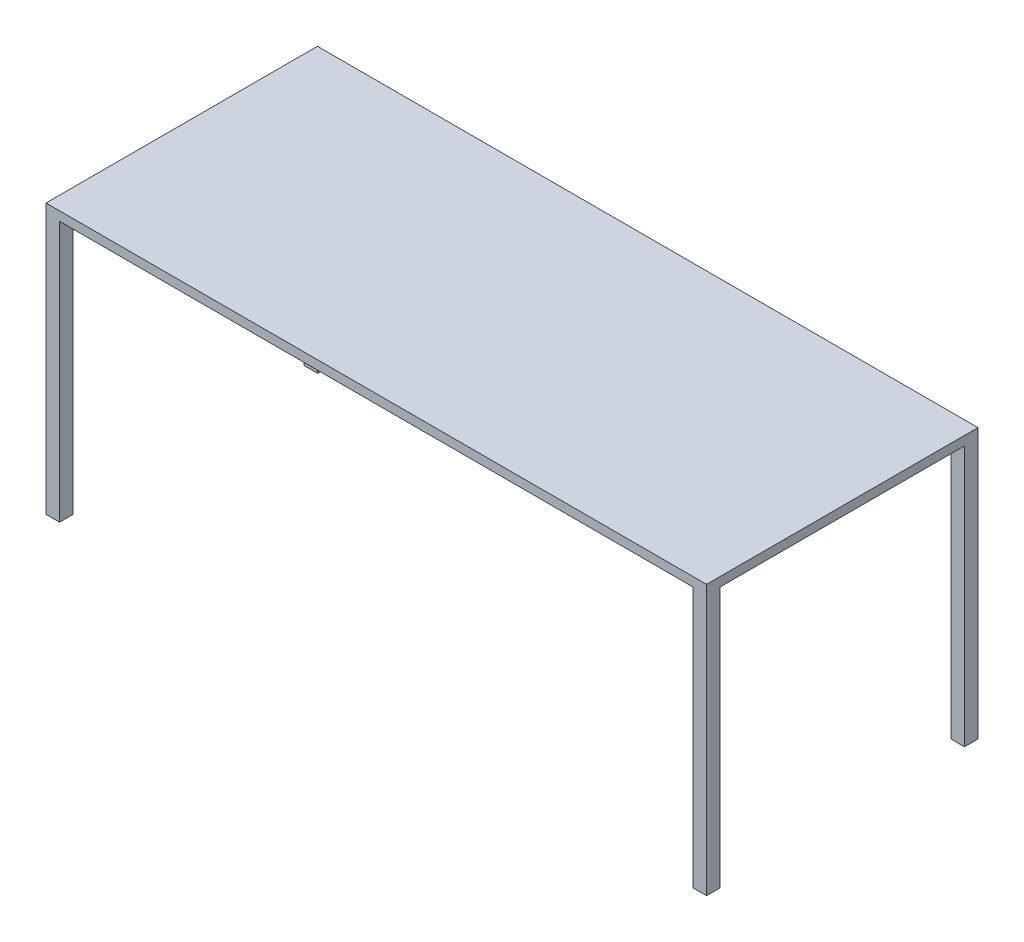
ISO-10303-21;
HEADER;
FILE_DESCRIPTION(('STEP AP214'),'2;1');
FILE_NAME('part.step','',(''),(''),'','','');
FILE_SCHEMA(('AUTOMOTIVE_DESIGN { 1 0 10303 214 1 1 1 1 }'));
ENDSEC;
DATA;
#1=APPLICATION_CONTEXT('core data for automotive mechanical design processes');
#2=APPLICATION_PROTOCOL_DEFINITION('international standard','automotive_design',2000,#1);
#3=PRODUCT_CONTEXT('',#1,'mechanical');
#4=PRODUCT('Part','Part','',(#3));
#5=PRODUCT_RELATED_PRODUCT_CATEGORY('part','',(#4));
#6=PRODUCT_DEFINITION_FORMATION('','',#4);
#7=PRODUCT_DEFINITION_CONTEXT('part definition',#1,'design');
#8=PRODUCT_DEFINITION('design','',#6,#7);
#9=PRODUCT_DEFINITION_SHAPE('','',#8);
#10=(LENGTH_UNIT() NAMED_UNIT(*) SI_UNIT(.MILLI.,.METRE.));
#11=(NAMED_UNIT(*) PLANE_ANGLE_UNIT() SI_UNIT($,.RADIAN.));
#12=(NAMED_UNIT(*) SI_UNIT($,.STERADIAN.) SOLID_ANGLE_UNIT());
#13=UNCERTAINTY_MEASURE_WITH_UNIT(LENGTH_MEASURE(1.E-05),#10,'distance_accuracy_value','');
#14=(GEOMETRIC_REPRESENTATION_CONTEXT(3) GLOBAL_UNCERTAINTY_ASSIGNED_CONTEXT((#13)) GLOBAL_UNIT_ASSIGNED_CONTEXT((#10,
#11,#12)) REPRESENTATION_CONTEXT('',''));
#15=CARTESIAN_POINT('',(0.,0.,0.));
#16=DIRECTION('',(0.,0.,1.));
#17=DIRECTION('',(1.,0.,0.));
#18=AXIS2_PLACEMENT_3D('',#15,#16,#17);
#19=CARTESIAN_POINT('',(0.,0.,0.));
#20=DIRECTION('',(0.,1.,0.));
#21=DIRECTION('',(0.,0.,1.));
#22=AXIS2_PLACEMENT_3D('',#19,#20,#21);
#23=PLANE('',#22);
#24=DIRECTION('',(1.,0.,0.));
#25=VECTOR('',#24,1.);
#26=CARTESIAN_POINT('',(927.1,0.,381.));
#27=LINE('',#26,#25);
#28=CARTESIAN_POINT('',(889.,0.,381.));
#29=VERTEX_POINT('',#28);
#30=CARTESIAN_POINT('',(927.1,0.,381.));
#31=VERTEX_POINT('',#30);
#32=EDGE_CURVE('E257',#29,#31,#27,.T.);
#33=ORIENTED_EDGE('',*,*,#32,.F.);
#34=DIRECTION('',(0.,0.,1.));
#35=VECTOR('',#34,1.);
#36=CARTESIAN_POINT('',(889.,0.,381.));
#37=LINE('',#36,#35);
#38=CARTESIAN_POINT('',(889.,0.,342.9));
#39=VERTEX_POINT('',#38);
#40=EDGE_CURVE('E177',#39,#29,#37,.T.);
#41=ORIENTED_EDGE('',*,*,#40,.F.);
#42=DIRECTION('',(-1.,0.,0.));
#43=VECTOR('',#42,1.);
#44=CARTESIAN_POINT('',(889.,0.,342.9));
#45=LINE('',#44,#43);
#46=CARTESIAN_POINT('',(927.1,0.,342.9));
#47=VERTEX_POINT('',#46);
#48=EDGE_CURVE('E179',#47,#39,#45,.T.);
#49=ORIENTED_EDGE('',*,*,#48,.F.);
#50=DIRECTION('',(0.,0.,-1.));
#51=VECTOR('',#50,1.);
#52=CARTESIAN_POINT('',(927.1,0.,381.));
#53=LINE('',#52,#51);
#54=EDGE_CURVE('E262',#31,#47,#53,.T.);
#55=ORIENTED_EDGE('',*,*,#54,.F.);
#56=EDGE_LOOP('',(#33,#41,#49,#55));
#57=FACE_BOUND('',#56,.T.);
#58=ADVANCED_FACE('F34',(#57),#23,.F.);
#59=CARTESIAN_POINT('',(927.1,0.,-342.9));
#60=VERTEX_POINT('',#59);
#61=CARTESIAN_POINT('',(927.1,0.,-381.));
#62=VERTEX_POINT('',#61);
#63=EDGE_CURVE('E261',#60,#62,#53,.T.);
#64=ORIENTED_EDGE('',*,*,#63,.F.);
#65=DIRECTION('',(1.,0.,0.));
#66=VECTOR('',#65,1.);
#67=CARTESIAN_POINT('',(889.,0.,-342.9));
#68=LINE('',#67,#66);
#69=CARTESIAN_POINT('',(889.,0.,-342.9));
#70=VERTEX_POINT('',#69);
#71=EDGE_CURVE('E218',#70,#60,#68,.T.);
#72=ORIENTED_EDGE('',*,*,#71,.F.);
#73=DIRECTION('',(0.,0.,1.));
#74=VECTOR('',#73,1.);
#75=CARTESIAN_POINT('',(889.,0.,-342.9));
#76=LINE('',#75,#74);
#77=CARTESIAN_POINT('',(889.,0.,-381.));
#78=VERTEX_POINT('',#77);
#79=EDGE_CURVE('E215',#78,#70,#76,.T.);
#80=ORIENTED_EDGE('',*,*,#79,.F.);
#81=DIRECTION('',(-1.,0.,0.));
#82=VECTOR('',#81,1.);
#83=CARTESIAN_POINT('',(927.1,0.,-381.));
#84=LINE('',#83,#82);
#85=EDGE_CURVE('E248',#62,#78,#84,.T.);
#86=ORIENTED_EDGE('',*,*,#85,.F.);
#87=EDGE_LOOP('',(#64,#72,#80,#86));
#88=FACE_BOUND('',#87,.T.);
#89=ADVANCED_FACE('F292',(#88),#23,.F.);
#90=CARTESIAN_POINT('',(-889.,0.,-381.));
#91=VERTEX_POINT('',#90);
#92=CARTESIAN_POINT('',(-927.1,0.,-381.));
#93=VERTEX_POINT('',#92);
#94=EDGE_CURVE('E79',#91,#93,#84,.T.);
#95=ORIENTED_EDGE('',*,*,#94,.F.);
#96=DIRECTION('',(0.,0.,-1.));
#97=VECTOR('',#96,1.);
#98=CARTESIAN_POINT('',(-889.,0.,-342.9));
#99=LINE('',#98,#97);
#100=CARTESIAN_POINT('',(-889.,0.,-342.9));
#101=VERTEX_POINT('',#100);
#102=EDGE_CURVE('E213',#101,#91,#99,.T.);
#103=ORIENTED_EDGE('',*,*,#102,.F.);
#104=DIRECTION('',(1.,0.,0.));
#105=VECTOR('',#104,1.);
#106=CARTESIAN_POINT('',(-927.1,0.,-342.9));
#107=LINE('',#106,#105);
#108=CARTESIAN_POINT('',(-927.1,0.,-342.9));
#109=VERTEX_POINT('',#108);
#110=EDGE_CURVE('E210',#109,#101,#107,.T.);
#111=ORIENTED_EDGE('',*,*,#110,.F.);
#112=DIRECTION('',(0.,0.,1.));
#113=VECTOR('',#112,1.);
#114=CARTESIAN_POINT('',(-927.1,0.,381.));
#115=LINE('',#114,#113);
#116=EDGE_CURVE('E254',#93,#109,#115,.T.);
#117=ORIENTED_EDGE('',*,*,#116,.F.);
#118=EDGE_LOOP('',(#95,#103,#111,#117));
#119=FACE_BOUND('',#118,.T.);
#120=ADVANCED_FACE('F311',(#119),#23,.F.);
#121=CARTESIAN_POINT('',(-927.1,756.92,381.));
#122=DIRECTION('',(1.,0.,0.));
#123=DIRECTION('',(0.,0.,-1.));
#124=AXIS2_PLACEMENT_3D('',#121,#122,#123);
#125=PLANE('',#124);
#126=ORIENTED_EDGE('',*,*,#116,.T.);
#127=DIRECTION('',(0.,-1.,0.));
#128=VECTOR('',#127,1.);
#129=CARTESIAN_POINT('',(-927.1,731.52,-342.9));
#130=LINE('',#129,#128);
#131=CARTESIAN_POINT('',(-927.1,731.52,-342.9));
#132=VERTEX_POINT('',#131);
#133=EDGE_CURVE('E243',#132,#109,#130,.T.);
#134=ORIENTED_EDGE('',*,*,#133,.F.);
#135=DIRECTION('',(0.,0.,-1.));
#136=VECTOR('',#135,1.);
#137=CARTESIAN_POINT('',(-927.1,731.52,342.9));
#138=LINE('',#137,#136);
#139=CARTESIAN_POINT('',(-927.1,731.52,342.9));
#140=VERTEX_POINT('',#139);
#141=EDGE_CURVE('E171',#140,#132,#138,.T.);
#142=ORIENTED_EDGE('',*,*,#141,.F.);
#143=DIRECTION('',(0.,-1.,0.));
#144=VECTOR('',#143,1.);
#145=CARTESIAN_POINT('',(-927.1,731.52,342.9));
#146=LINE('',#145,#144);
#147=CARTESIAN_POINT('',(-927.1,0.,342.9));
#148=VERTEX_POINT('',#147);
#149=EDGE_CURVE('E161',#140,#148,#146,.T.);
#150=ORIENTED_EDGE('',*,*,#149,.T.);
#151=CARTESIAN_POINT('',(-927.1,0.,381.));
#152=VERTEX_POINT('',#151);
#153=EDGE_CURVE('E224',#148,#152,#115,.T.);
#154=ORIENTED_EDGE('',*,*,#153,.T.);
#155=DIRECTION('',(0.,-1.,0.));
#156=VECTOR('',#155,1.);
#157=CARTESIAN_POINT('',(-927.1,756.92,381.));
#158=LINE('',#157,#156);
#159=CARTESIAN_POINT('',(-927.1,756.92,381.));
#160=VERTEX_POINT('',#159);
#161=EDGE_CURVE('E11',#160,#152,#158,.T.);
#162=ORIENTED_EDGE('',*,*,#161,.F.);
#163=DIRECTION('',(0.,0.,1.));
#164=VECTOR('',#163,1.);
#165=CARTESIAN_POINT('',(-927.1,756.92,381.));
#166=LINE('',#165,#164);
#167=CARTESIAN_POINT('',(-927.1,756.92,-381.));
#168=VERTEX_POINT('',#167);
#169=EDGE_CURVE('E246',#168,#160,#166,.T.);
#170=ORIENTED_EDGE('',*,*,#169,.F.);
#171=DIRECTION('',(0.,-1.,0.));
#172=VECTOR('',#171,1.);
#173=CARTESIAN_POINT('',(-927.1,756.92,-381.));
#174=LINE('',#173,#172);
#175=EDGE_CURVE('E253',#168,#93,#174,.T.);
#176=ORIENTED_EDGE('',*,*,#175,.T.);
#177=EDGE_LOOP('',(#126,#134,#142,#150,#154,#162,#170,#176));
#178=FACE_BOUND('',#177,.T.);
#179=ADVANCED_FACE('F36',(#178),#125,.F.);
#180=CARTESIAN_POINT('',(927.1,756.92,381.));
#181=DIRECTION('',(0.,0.,-1.));
#182=DIRECTION('',(-1.,0.,0.));
#183=AXIS2_PLACEMENT_3D('',#180,#181,#182);
#184=PLANE('',#183);
#185=CARTESIAN_POINT('',(-889.,0.,381.));
#186=VERTEX_POINT('',#185);
#187=EDGE_CURVE('E258',#152,#186,#27,.T.);
#188=ORIENTED_EDGE('',*,*,#187,.T.);
#189=DIRECTION('',(0.,-1.,0.));
#190=VECTOR('',#189,1.);
#191=CARTESIAN_POINT('',(-889.,731.52,381.));
#192=LINE('',#191,#190);
#193=CARTESIAN_POINT('',(-889.,731.52,381.));
#194=VERTEX_POINT('',#193);
#195=EDGE_CURVE('E222',#194,#186,#192,.T.);
#196=ORIENTED_EDGE('',*,*,#195,.F.);
#197=DIRECTION('',(-1.,0.,0.));
#198=VECTOR('',#197,1.);
#199=CARTESIAN_POINT('',(-889.,731.52,381.));
#200=LINE('',#199,#198);
#201=CARTESIAN_POINT('',(889.,731.52,381.));
#202=VERTEX_POINT('',#201);
#203=EDGE_CURVE('E162',#202,#194,#200,.T.);
#204=ORIENTED_EDGE('',*,*,#203,.F.);
#205=DIRECTION('',(0.,-1.,0.));
#206=VECTOR('',#205,1.);
#207=CARTESIAN_POINT('',(889.,731.52,381.));
#208=LINE('',#207,#206);
#209=EDGE_CURVE('E225',#202,#29,#208,.T.);
#210=ORIENTED_EDGE('',*,*,#209,.T.);
#211=ORIENTED_EDGE('',*,*,#32,.T.);
#212=DIRECTION('',(0.,-1.,0.));
#213=VECTOR('',#212,1.);
#214=CARTESIAN_POINT('',(927.1,756.92,381.));
#215=LINE('',#214,#213);
#216=CARTESIAN_POINT('',(927.1,756.92,381.));
#217=VERTEX_POINT('',#216);
#218=EDGE_CURVE('E42',#217,#31,#215,.T.);
#219=ORIENTED_EDGE('',*,*,#218,.F.);
#220=DIRECTION('',(1.,0.,0.));
#221=VECTOR('',#220,1.);
#222=CARTESIAN_POINT('',(927.1,756.92,381.));
#223=LINE('',#222,#221);
#224=EDGE_CURVE('E86',#160,#217,#223,.T.);
#225=ORIENTED_EDGE('',*,*,#224,.F.);
#226=ORIENTED_EDGE('',*,*,#161,.T.);
#227=EDGE_LOOP('',(#188,#196,#204,#210,#211,#219,#225,#226));
#228=FACE_BOUND('',#227,.T.);
#229=ADVANCED_FACE('F321',(#228),#184,.F.);
#230=CARTESIAN_POINT('',(927.1,756.92,381.));
#231=DIRECTION('',(-1.,0.,0.));
#232=DIRECTION('',(0.,0.,1.));
#233=AXIS2_PLACEMENT_3D('',#230,#231,#232);
#234=PLANE('',#233);
#235=ORIENTED_EDGE('',*,*,#54,.T.);
#236=DIRECTION('',(0.,-1.,0.));
#237=VECTOR('',#236,1.);
#238=CARTESIAN_POINT('',(927.1,731.52,342.9));
#239=LINE('',#238,#237);
#240=CARTESIAN_POINT('',(927.1,731.52,342.9));
#241=VERTEX_POINT('',#240);
#242=EDGE_CURVE('E230',#241,#47,#239,.T.);
#243=ORIENTED_EDGE('',*,*,#242,.F.);
#244=DIRECTION('',(0.,0.,1.));
#245=VECTOR('',#244,1.);
#246=CARTESIAN_POINT('',(927.1,731.52,342.9));
#247=LINE('',#246,#245);
#248=CARTESIAN_POINT('',(927.1,731.52,-342.9));
#249=VERTEX_POINT('',#248);
#250=EDGE_CURVE('E198',#249,#241,#247,.T.);
#251=ORIENTED_EDGE('',*,*,#250,.F.);
#252=DIRECTION('',(0.,-1.,0.));
#253=VECTOR('',#252,1.);
#254=CARTESIAN_POINT('',(927.1,731.52,-342.9));
#255=LINE('',#254,#253);
#256=EDGE_CURVE('E232',#249,#60,#255,.T.);
#257=ORIENTED_EDGE('',*,*,#256,.T.);
#258=ORIENTED_EDGE('',*,*,#63,.T.);
#259=DIRECTION('',(0.,-1.,0.));
#260=VECTOR('',#259,1.);
#261=CARTESIAN_POINT('',(927.1,756.92,-381.));
#262=LINE('',#261,#260);
#263=CARTESIAN_POINT('',(927.1,756.92,-381.));
#264=VERTEX_POINT('',#263);
#265=EDGE_CURVE('E268',#264,#62,#262,.T.);
#266=ORIENTED_EDGE('',*,*,#265,.F.);
#267=DIRECTION('',(0.,0.,-1.));
#268=VECTOR('',#267,1.);
#269=CARTESIAN_POINT('',(927.1,756.92,381.));
#270=LINE('',#269,#268);
#271=EDGE_CURVE('E250',#217,#264,#270,.T.);
#272=ORIENTED_EDGE('',*,*,#271,.F.);
#273=ORIENTED_EDGE('',*,*,#218,.T.);
#274=EDGE_LOOP('',(#235,#243,#251,#257,#258,#266,#272,#273));
#275=FACE_BOUND('',#274,.T.);
#276=ADVANCED_FACE('F274',(#275),#234,.F.);
#277=CARTESIAN_POINT('',(927.1,756.92,-381.));
#278=DIRECTION('',(0.,0.,1.));
#279=DIRECTION('',(1.,0.,0.));
#280=AXIS2_PLACEMENT_3D('',#277,#278,#279);
#281=PLANE('',#280);
#282=ORIENTED_EDGE('',*,*,#85,.T.);
#283=DIRECTION('',(0.,-1.,0.));
#284=VECTOR('',#283,1.);
#285=CARTESIAN_POINT('',(889.,731.52,-381.));
#286=LINE('',#285,#284);
#287=CARTESIAN_POINT('',(889.,731.52,-381.));
#288=VERTEX_POINT('',#287);
#289=EDGE_CURVE('E237',#288,#78,#286,.T.);
#290=ORIENTED_EDGE('',*,*,#289,.F.);
#291=DIRECTION('',(1.,0.,0.));
#292=VECTOR('',#291,1.);
#293=CARTESIAN_POINT('',(-889.,731.52,-381.));
#294=LINE('',#293,#292);
#295=CARTESIAN_POINT('',(-889.,731.52,-381.));
#296=VERTEX_POINT('',#295);
#297=EDGE_CURVE('E189',#296,#288,#294,.T.);
#298=ORIENTED_EDGE('',*,*,#297,.F.);
#299=DIRECTION('',(0.,-1.,0.));
#300=VECTOR('',#299,1.);
#301=CARTESIAN_POINT('',(-889.,731.52,-381.));
#302=LINE('',#301,#300);
#303=EDGE_CURVE('E239',#296,#91,#302,.T.);
#304=ORIENTED_EDGE('',*,*,#303,.T.);
#305=ORIENTED_EDGE('',*,*,#94,.T.);
#306=ORIENTED_EDGE('',*,*,#175,.F.);
#307=DIRECTION('',(-1.,0.,0.));
#308=VECTOR('',#307,1.);
#309=CARTESIAN_POINT('',(927.1,756.92,-381.));
#310=LINE('',#309,#308);
#311=EDGE_CURVE('E58',#264,#168,#310,.T.);
#312=ORIENTED_EDGE('',*,*,#311,.F.);
#313=ORIENTED_EDGE('',*,*,#265,.T.);
#314=EDGE_LOOP('',(#282,#290,#298,#304,#305,#306,#312,#313));
#315=FACE_BOUND('',#314,.T.);
#316=ADVANCED_FACE('F294',(#315),#281,.F.);
#317=CARTESIAN_POINT('',(0.,756.92,0.));
#318=DIRECTION('',(0.,1.,0.));
#319=DIRECTION('',(0.,0.,1.));
#320=AXIS2_PLACEMENT_3D('',#317,#318,#319);
#321=PLANE('',#320);
#322=ORIENTED_EDGE('',*,*,#169,.T.);
#323=ORIENTED_EDGE('',*,*,#224,.T.);
#324=ORIENTED_EDGE('',*,*,#271,.T.);
#325=ORIENTED_EDGE('',*,*,#311,.T.);
#326=EDGE_LOOP('',(#322,#323,#324,#325));
#327=FACE_BOUND('',#326,.T.);
#328=ADVANCED_FACE('F300',(#327),#321,.T.);
#329=DIRECTION('',(-1.,0.,0.));
#330=VECTOR('',#329,1.);
#331=CARTESIAN_POINT('',(-927.1,0.,342.9));
#332=LINE('',#331,#330);
#333=CARTESIAN_POINT('',(-889.,0.,342.9));
#334=VERTEX_POINT('',#333);
#335=EDGE_CURVE('E208',#334,#148,#332,.T.);
#336=ORIENTED_EDGE('',*,*,#335,.F.);
#337=DIRECTION('',(0.,0.,-1.));
#338=VECTOR('',#337,1.);
#339=CARTESIAN_POINT('',(-889.,0.,381.));
#340=LINE('',#339,#338);
#341=EDGE_CURVE('E49',#186,#334,#340,.T.);
#342=ORIENTED_EDGE('',*,*,#341,.F.);
#343=ORIENTED_EDGE('',*,*,#187,.F.);
#344=ORIENTED_EDGE('',*,*,#153,.F.);
#345=EDGE_LOOP('',(#336,#342,#343,#344));
#346=FACE_BOUND('',#345,.T.);
#347=ADVANCED_FACE('F302',(#346),#23,.F.);
#348=CARTESIAN_POINT('',(-889.,731.52,381.));
#349=DIRECTION('',(-1.,0.,0.));
#350=DIRECTION('',(0.,0.,1.));
#351=AXIS2_PLACEMENT_3D('',#348,#349,#350);
#352=PLANE('',#351);
#353=ORIENTED_EDGE('',*,*,#341,.T.);
#354=DIRECTION('',(0.,-1.,0.));
#355=VECTOR('',#354,1.);
#356=CARTESIAN_POINT('',(-889.,731.52,342.9));
#357=LINE('',#356,#355);
#358=CARTESIAN_POINT('',(-889.,731.52,342.9));
#359=VERTEX_POINT('',#358);
#360=EDGE_CURVE('E153',#359,#334,#357,.T.);
#361=ORIENTED_EDGE('',*,*,#360,.F.);
#362=DIRECTION('',(0.,0.,-1.));
#363=VECTOR('',#362,1.);
#364=CARTESIAN_POINT('',(-889.,731.52,381.));
#365=LINE('',#364,#363);
#366=EDGE_CURVE('E157',#194,#359,#365,.T.);
#367=ORIENTED_EDGE('',*,*,#366,.F.);
#368=ORIENTED_EDGE('',*,*,#195,.T.);
#369=EDGE_LOOP('',(#353,#361,#367,#368));
#370=FACE_BOUND('',#369,.T.);
#371=ADVANCED_FACE('F155',(#370),#352,.F.);
#372=CARTESIAN_POINT('',(889.,731.52,381.));
#373=DIRECTION('',(1.,0.,0.));
#374=DIRECTION('',(0.,0.,-1.));
#375=AXIS2_PLACEMENT_3D('',#372,#373,#374);
#376=PLANE('',#375);
#377=ORIENTED_EDGE('',*,*,#40,.T.);
#378=ORIENTED_EDGE('',*,*,#209,.F.);
#379=DIRECTION('',(0.,0.,1.));
#380=VECTOR('',#379,1.);
#381=CARTESIAN_POINT('',(889.,731.52,381.));
#382=LINE('',#381,#380);
#383=CARTESIAN_POINT('',(889.,731.52,342.9));
#384=VERTEX_POINT('',#383);
#385=EDGE_CURVE('E204',#384,#202,#382,.T.);
#386=ORIENTED_EDGE('',*,*,#385,.F.);
#387=DIRECTION('',(0.,-1.,0.));
#388=VECTOR('',#387,1.);
#389=CARTESIAN_POINT('',(889.,731.52,342.9));
#390=LINE('',#389,#388);
#391=EDGE_CURVE('E228',#384,#39,#390,.T.);
#392=ORIENTED_EDGE('',*,*,#391,.T.);
#393=EDGE_LOOP('',(#377,#378,#386,#392));
#394=FACE_BOUND('',#393,.T.);
#395=ADVANCED_FACE('F377',(#394),#376,.F.);
#396=CARTESIAN_POINT('',(889.,731.52,342.9));
#397=DIRECTION('',(0.,0.,1.));
#398=DIRECTION('',(1.,0.,0.));
#399=AXIS2_PLACEMENT_3D('',#396,#397,#398);
#400=PLANE('',#399);
#401=ORIENTED_EDGE('',*,*,#48,.T.);
#402=ORIENTED_EDGE('',*,*,#391,.F.);
#403=DIRECTION('',(-1.,0.,0.));
#404=VECTOR('',#403,1.);
#405=CARTESIAN_POINT('',(889.,731.52,342.9));
#406=LINE('',#405,#404);
#407=EDGE_CURVE('E201',#241,#384,#406,.T.);
#408=ORIENTED_EDGE('',*,*,#407,.F.);
#409=ORIENTED_EDGE('',*,*,#242,.T.);
#410=EDGE_LOOP('',(#401,#402,#408,#409));
#411=FACE_BOUND('',#410,.T.);
#412=ADVANCED_FACE('F282',(#411),#400,.F.);
#413=CARTESIAN_POINT('',(889.,731.52,-342.9));
#414=DIRECTION('',(0.,0.,-1.));
#415=DIRECTION('',(-1.,0.,0.));
#416=AXIS2_PLACEMENT_3D('',#413,#414,#415);
#417=PLANE('',#416);
#418=ORIENTED_EDGE('',*,*,#71,.T.);
#419=ORIENTED_EDGE('',*,*,#256,.F.);
#420=DIRECTION('',(1.,0.,0.));
#421=VECTOR('',#420,1.);
#422=CARTESIAN_POINT('',(889.,731.52,-342.9));
#423=LINE('',#422,#421);
#424=CARTESIAN_POINT('',(889.,731.52,-342.9));
#425=VERTEX_POINT('',#424);
#426=EDGE_CURVE('E195',#425,#249,#423,.T.);
#427=ORIENTED_EDGE('',*,*,#426,.F.);
#428=DIRECTION('',(0.,-1.,0.));
#429=VECTOR('',#428,1.);
#430=CARTESIAN_POINT('',(889.,731.52,-342.9));
#431=LINE('',#430,#429);
#432=EDGE_CURVE('E235',#425,#70,#431,.T.);
#433=ORIENTED_EDGE('',*,*,#432,.T.);
#434=EDGE_LOOP('',(#418,#419,#427,#433));
#435=FACE_BOUND('',#434,.T.);
#436=ADVANCED_FACE('F288',(#435),#417,.F.);
#437=CARTESIAN_POINT('',(889.,731.52,-342.9));
#438=DIRECTION('',(1.,0.,0.));
#439=DIRECTION('',(0.,0.,-1.));
#440=AXIS2_PLACEMENT_3D('',#437,#438,#439);
#441=PLANE('',#440);
#442=ORIENTED_EDGE('',*,*,#79,.T.);
#443=ORIENTED_EDGE('',*,*,#432,.F.);
#444=DIRECTION('',(0.,0.,1.));
#445=VECTOR('',#444,1.);
#446=CARTESIAN_POINT('',(889.,731.52,-342.9));
#447=LINE('',#446,#445);
#448=EDGE_CURVE('E192',#288,#425,#447,.T.);
#449=ORIENTED_EDGE('',*,*,#448,.F.);
#450=ORIENTED_EDGE('',*,*,#289,.T.);
#451=EDGE_LOOP('',(#442,#443,#449,#450));
#452=FACE_BOUND('',#451,.T.);
#453=ADVANCED_FACE('F403',(#452),#441,.F.);
#454=CARTESIAN_POINT('',(-889.,731.52,-342.9));
#455=DIRECTION('',(-1.,0.,0.));
#456=DIRECTION('',(0.,0.,1.));
#457=AXIS2_PLACEMENT_3D('',#454,#455,#456);
#458=PLANE('',#457);
#459=ORIENTED_EDGE('',*,*,#102,.T.);
#460=ORIENTED_EDGE('',*,*,#303,.F.);
#461=DIRECTION('',(0.,0.,-1.));
#462=VECTOR('',#461,1.);
#463=CARTESIAN_POINT('',(-889.,731.52,-342.9));
#464=LINE('',#463,#462);
#465=CARTESIAN_POINT('',(-889.,731.52,-342.9));
#466=VERTEX_POINT('',#465);
#467=EDGE_CURVE('E186',#466,#296,#464,.T.);
#468=ORIENTED_EDGE('',*,*,#467,.F.);
#469=DIRECTION('',(0.,-1.,0.));
#470=VECTOR('',#469,1.);
#471=CARTESIAN_POINT('',(-889.,731.52,-342.9));
#472=LINE('',#471,#470);
#473=EDGE_CURVE('E241',#466,#101,#472,.T.);
#474=ORIENTED_EDGE('',*,*,#473,.T.);
#475=EDGE_LOOP('',(#459,#460,#468,#474));
#476=FACE_BOUND('',#475,.T.);
#477=ADVANCED_FACE('F336',(#476),#458,.F.);
#478=CARTESIAN_POINT('',(-927.1,731.52,-342.9));
#479=DIRECTION('',(0.,0.,-1.));
#480=DIRECTION('',(-1.,0.,0.));
#481=AXIS2_PLACEMENT_3D('',#478,#479,#480);
#482=PLANE('',#481);
#483=ORIENTED_EDGE('',*,*,#110,.T.);
#484=ORIENTED_EDGE('',*,*,#473,.F.);
#485=DIRECTION('',(1.,0.,0.));
#486=VECTOR('',#485,1.);
#487=CARTESIAN_POINT('',(-927.1,731.52,-342.9));
#488=LINE('',#487,#486);
#489=EDGE_CURVE('E183',#132,#466,#488,.T.);
#490=ORIENTED_EDGE('',*,*,#489,.F.);
#491=ORIENTED_EDGE('',*,*,#133,.T.);
#492=EDGE_LOOP('',(#483,#484,#490,#491));
#493=FACE_BOUND('',#492,.T.);
#494=ADVANCED_FACE('F332',(#493),#482,.F.);
#495=CARTESIAN_POINT('',(-927.1,731.52,342.9));
#496=DIRECTION('',(0.,0.,1.));
#497=DIRECTION('',(1.,0.,0.));
#498=AXIS2_PLACEMENT_3D('',#495,#496,#497);
#499=PLANE('',#498);
#500=ORIENTED_EDGE('',*,*,#335,.T.);
#501=ORIENTED_EDGE('',*,*,#149,.F.);
#502=DIRECTION('',(-1.,0.,0.));
#503=VECTOR('',#502,1.);
#504=CARTESIAN_POINT('',(-927.1,731.52,342.9));
#505=LINE('',#504,#503);
#506=EDGE_CURVE('E165',#359,#140,#505,.T.);
#507=ORIENTED_EDGE('',*,*,#506,.F.);
#508=ORIENTED_EDGE('',*,*,#360,.T.);
#509=EDGE_LOOP('',(#500,#501,#507,#508));
#510=FACE_BOUND('',#509,.T.);
#511=ADVANCED_FACE('F166',(#510),#499,.F.);
#512=CARTESIAN_POINT('',(0.,731.52,0.));
#513=DIRECTION('',(0.,-1.,0.));
#514=DIRECTION('',(0.,0.,-1.));
#515=AXIS2_PLACEMENT_3D('',#512,#513,#514);
#516=PLANE('',#515);
#517=ORIENTED_EDGE('',*,*,#366,.T.);
#518=ORIENTED_EDGE('',*,*,#506,.T.);
#519=ORIENTED_EDGE('',*,*,#141,.T.);
#520=ORIENTED_EDGE('',*,*,#489,.T.);
#521=ORIENTED_EDGE('',*,*,#467,.T.);
#522=ORIENTED_EDGE('',*,*,#297,.T.);
#523=ORIENTED_EDGE('',*,*,#448,.T.);
#524=ORIENTED_EDGE('',*,*,#426,.T.);
#525=ORIENTED_EDGE('',*,*,#250,.T.);
#526=ORIENTED_EDGE('',*,*,#407,.T.);
#527=ORIENTED_EDGE('',*,*,#385,.T.);
#528=ORIENTED_EDGE('',*,*,#203,.T.);
#529=EDGE_LOOP('',(#517,#518,#519,#520,#521,#522,#523,#524,#525,#526,#527,#528));
#530=FACE_BOUND('',#529,.T.);
#531=ADVANCED_FACE('F173',(#530),#516,.T.);
#532=CLOSED_SHELL('',(#58,#89,#120,#179,#229,#276,#316,#328,#347,#371,#395,#412,#436,#453,#477,
#494,#511,#531));
#533=MANIFOLD_SOLID_BREP('B2',#532);
#534=ADVANCED_BREP_SHAPE_REPRESENTATION('',(#18,#533),#14);
#535=SHAPE_DEFINITION_REPRESENTATION(#9,#534);
ENDSEC;
END-ISO-10303-21;
